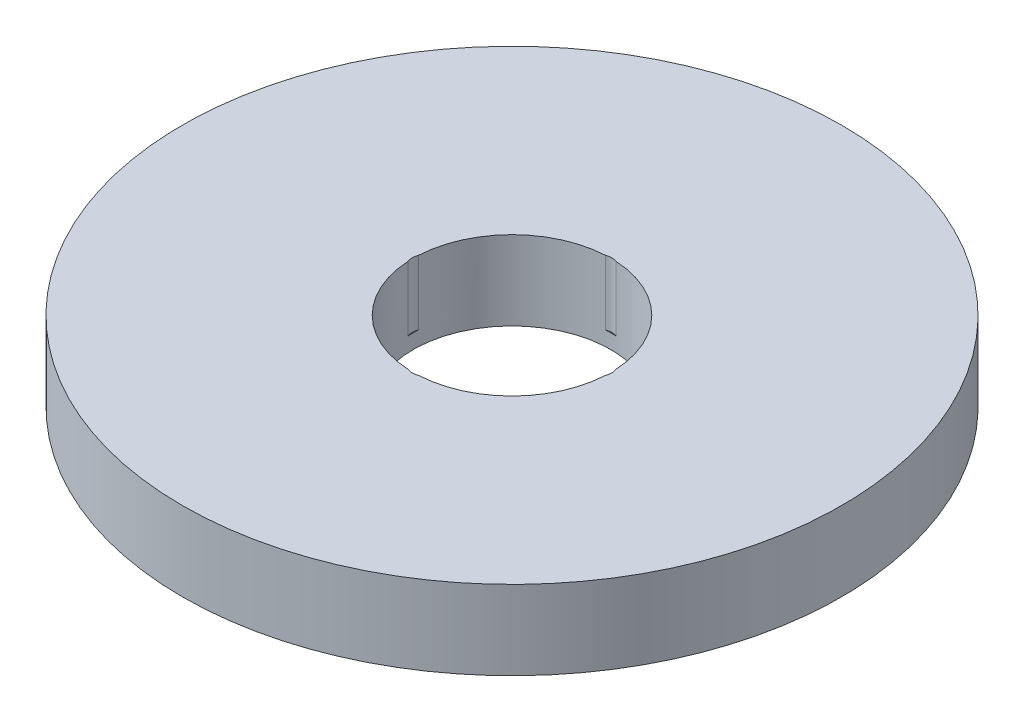
ISO-10303-21;
HEADER;
FILE_DESCRIPTION(('STEP AP214'),'2;1');
FILE_NAME('part.step','',(''),(''),'','','');
FILE_SCHEMA(('AUTOMOTIVE_DESIGN { 1 0 10303 214 1 1 1 1 }'));
ENDSEC;
DATA;
#1=APPLICATION_CONTEXT('core data for automotive mechanical design processes');
#2=APPLICATION_PROTOCOL_DEFINITION('international standard','automotive_design',2000,#1);
#3=PRODUCT_CONTEXT('',#1,'mechanical');
#4=PRODUCT('Part','Part','',(#3));
#5=PRODUCT_RELATED_PRODUCT_CATEGORY('part','',(#4));
#6=PRODUCT_DEFINITION_FORMATION('','',#4);
#7=PRODUCT_DEFINITION_CONTEXT('part definition',#1,'design');
#8=PRODUCT_DEFINITION('design','',#6,#7);
#9=PRODUCT_DEFINITION_SHAPE('','',#8);
#10=(LENGTH_UNIT() NAMED_UNIT(*) SI_UNIT(.MILLI.,.METRE.));
#11=(NAMED_UNIT(*) PLANE_ANGLE_UNIT() SI_UNIT($,.RADIAN.));
#12=(NAMED_UNIT(*) SI_UNIT($,.STERADIAN.) SOLID_ANGLE_UNIT());
#13=UNCERTAINTY_MEASURE_WITH_UNIT(LENGTH_MEASURE(1.E-05),#10,'distance_accuracy_value','');
#14=(GEOMETRIC_REPRESENTATION_CONTEXT(3) GLOBAL_UNCERTAINTY_ASSIGNED_CONTEXT((#13)) GLOBAL_UNIT_ASSIGNED_CONTEXT((#10,
#11,#12)) REPRESENTATION_CONTEXT('',''));
#15=CARTESIAN_POINT('',(0.,0.,0.));
#16=DIRECTION('',(0.,0.,1.));
#17=DIRECTION('',(1.,0.,0.));
#18=AXIS2_PLACEMENT_3D('',#15,#16,#17);
#19=CARTESIAN_POINT('',(0.,12.,0.));
#20=DIRECTION('',(0.,-1.,0.));
#21=DIRECTION('',(0.,0.,-1.));
#22=AXIS2_PLACEMENT_3D('',#19,#20,#21);
#23=CYLINDRICAL_SURFACE('',#22,50.);
#24=CARTESIAN_POINT('',(0.,12.,0.));
#25=DIRECTION('',(0.,1.,0.));
#26=DIRECTION('',(0.,0.,1.));
#27=AXIS2_PLACEMENT_3D('',#24,#25,#26);
#28=CIRCLE('',#27,50.);
#29=CARTESIAN_POINT('',(0.,12.,50.));
#30=VERTEX_POINT('',#29);
#31=EDGE_CURVE('E148',#30,#30,#28,.T.);
#32=ORIENTED_EDGE('',*,*,#31,.F.);
#33=EDGE_LOOP('',(#32));
#34=FACE_BOUND('',#33,.T.);
#35=CARTESIAN_POINT('',(0.,0.,0.));
#36=DIRECTION('',(0.,1.,0.));
#37=DIRECTION('',(0.,0.,1.));
#38=AXIS2_PLACEMENT_3D('',#35,#36,#37);
#39=CIRCLE('',#38,50.);
#40=CARTESIAN_POINT('',(0.,0.,50.));
#41=VERTEX_POINT('',#40);
#42=EDGE_CURVE('E139',#41,#41,#39,.T.);
#43=ORIENTED_EDGE('',*,*,#42,.T.);
#44=EDGE_LOOP('',(#43));
#45=FACE_BOUND('',#44,.T.);
#46=ADVANCED_FACE('F39',(#34,#45),#23,.T.);
#47=CARTESIAN_POINT('',(0.,12.,0.));
#48=DIRECTION('',(0.,1.,0.));
#49=DIRECTION('',(0.,0.,1.));
#50=AXIS2_PLACEMENT_3D('',#47,#48,#49);
#51=PLANE('',#50);
#52=CARTESIAN_POINT('',(0.,12.,13.0241337652441));
#53=DIRECTION('',(0.,1.,0.));
#54=DIRECTION('',(1.,0.,0.));
#55=AXIS2_PLACEMENT_3D('',#52,#53,#54);
#56=CIRCLE('',#55,2.10601295915814);
#57=CARTESIAN_POINT('',(-0.781934237082685,12.,14.9796054303469));
#58=VERTEX_POINT('',#57);
#59=CARTESIAN_POINT('',(0.78193423708279,12.,14.9796054303469));
#60=VERTEX_POINT('',#59);
#61=EDGE_CURVE('E175',#58,#60,#56,.T.);
#62=ORIENTED_EDGE('',*,*,#61,.F.);
#63=CARTESIAN_POINT('',(0.,12.,0.));
#64=DIRECTION('',(0.,1.,0.));
#65=DIRECTION('',(0.,0.,1.));
#66=AXIS2_PLACEMENT_3D('',#63,#64,#65);
#67=CIRCLE('',#66,15.);
#68=CARTESIAN_POINT('',(-14.9796054303469,12.,0.781934237082738));
#69=VERTEX_POINT('',#68);
#70=EDGE_CURVE('E134',#69,#58,#67,.T.);
#71=ORIENTED_EDGE('',*,*,#70,.F.);
#72=CARTESIAN_POINT('',(-13.0241337652441,12.,0.));
#73=DIRECTION('',(0.,1.,0.));
#74=DIRECTION('',(0.,0.,1.));
#75=AXIS2_PLACEMENT_3D('',#72,#73,#74);
#76=CIRCLE('',#75,2.10601295915814);
#77=CARTESIAN_POINT('',(-14.9796054303469,12.,-0.781934237082738));
#78=VERTEX_POINT('',#77);
#79=EDGE_CURVE('E143',#78,#69,#76,.T.);
#80=ORIENTED_EDGE('',*,*,#79,.F.);
#81=CARTESIAN_POINT('',(-0.781934237082895,12.,-14.9796054303469));
#82=VERTEX_POINT('',#81);
#83=EDGE_CURVE('E123',#82,#78,#67,.T.);
#84=ORIENTED_EDGE('',*,*,#83,.F.);
#85=CARTESIAN_POINT('',(-1.3642055998784E-13,12.,-13.0241337652441));
#86=DIRECTION('',(0.,1.,0.));
#87=DIRECTION('',(-1.,0.,0.));
#88=AXIS2_PLACEMENT_3D('',#85,#86,#87);
#89=CIRCLE('',#88,2.10601295915814);
#90=CARTESIAN_POINT('',(0.781934237082581,12.,-14.9796054303469));
#91=VERTEX_POINT('',#90);
#92=EDGE_CURVE('E106',#91,#82,#89,.T.);
#93=ORIENTED_EDGE('',*,*,#92,.F.);
#94=CARTESIAN_POINT('',(14.9796054303469,12.,-0.781934237082738));
#95=VERTEX_POINT('',#94);
#96=EDGE_CURVE('E125',#95,#91,#67,.T.);
#97=ORIENTED_EDGE('',*,*,#96,.F.);
#98=CARTESIAN_POINT('',(13.0241337652441,12.,0.));
#99=DIRECTION('',(0.,1.,0.));
#100=DIRECTION('',(0.,0.,-1.));
#101=AXIS2_PLACEMENT_3D('',#98,#99,#100);
#102=CIRCLE('',#101,2.10601295915814);
#103=CARTESIAN_POINT('',(14.9796054303469,12.,0.781934237082738));
#104=VERTEX_POINT('',#103);
#105=EDGE_CURVE('E286',#104,#95,#102,.T.);
#106=ORIENTED_EDGE('',*,*,#105,.F.);
#107=EDGE_CURVE('E135',#60,#104,#67,.T.);
#108=ORIENTED_EDGE('',*,*,#107,.F.);
#109=EDGE_LOOP('',(#62,#71,#80,#84,#93,#97,#106,#108));
#110=FACE_BOUND('',#109,.T.);
#111=ORIENTED_EDGE('',*,*,#31,.T.);
#112=EDGE_LOOP('',(#111));
#113=FACE_BOUND('',#112,.T.);
#114=ADVANCED_FACE('F118',(#110,#113),#51,.T.);
#115=CARTESIAN_POINT('',(0.,0.,0.));
#116=DIRECTION('',(0.,1.,0.));
#117=DIRECTION('',(0.,0.,1.));
#118=AXIS2_PLACEMENT_3D('',#115,#116,#117);
#119=PLANE('',#118);
#120=CARTESIAN_POINT('',(0.,0.,0.));
#121=DIRECTION('',(0.,1.,0.));
#122=DIRECTION('',(0.,0.,1.));
#123=AXIS2_PLACEMENT_3D('',#120,#121,#122);
#124=CIRCLE('',#123,15.);
#125=CARTESIAN_POINT('',(0.,0.,15.));
#126=VERTEX_POINT('',#125);
#127=EDGE_CURVE('E136',#126,#126,#124,.T.);
#128=ORIENTED_EDGE('',*,*,#127,.T.);
#129=EDGE_LOOP('',(#128));
#130=FACE_BOUND('',#129,.T.);
#131=ORIENTED_EDGE('',*,*,#42,.F.);
#132=EDGE_LOOP('',(#131));
#133=FACE_BOUND('',#132,.T.);
#134=ADVANCED_FACE('F187',(#130,#133),#119,.F.);
#135=CARTESIAN_POINT('',(0.,12.,0.));
#136=DIRECTION('',(0.,-1.,0.));
#137=DIRECTION('',(0.,0.,-1.));
#138=AXIS2_PLACEMENT_3D('',#135,#136,#137);
#139=CYLINDRICAL_SURFACE('',#138,15.);
#140=DIRECTION('',(0.,1.,0.));
#141=VECTOR('',#140,1.);
#142=CARTESIAN_POINT('',(-0.781934237082687,7.10051957144951,14.9796054303469));
#143=LINE('',#142,#141);
#144=CARTESIAN_POINT('',(-0.781934237082685,2.20103914289903,14.9796054303469));
#145=VERTEX_POINT('',#144);
#146=EDGE_CURVE('E11',#145,#58,#143,.T.);
#147=ORIENTED_EDGE('',*,*,#146,.F.);
#148=CARTESIAN_POINT('',(0.,2.20103914289903,0.));
#149=DIRECTION('',(0.,1.,0.));
#150=DIRECTION('',(0.,0.,1.));
#151=AXIS2_PLACEMENT_3D('',#148,#149,#150);
#152=CIRCLE('',#151,15.);
#153=CARTESIAN_POINT('',(0.78193423708279,2.20103914289903,14.9796054303469));
#154=VERTEX_POINT('',#153);
#155=EDGE_CURVE('E170',#145,#154,#152,.T.);
#156=ORIENTED_EDGE('',*,*,#155,.T.);
#157=DIRECTION('',(0.,1.,0.));
#158=VECTOR('',#157,1.);
#159=CARTESIAN_POINT('',(0.781934237082792,7.10051957144951,14.9796054303469));
#160=LINE('',#159,#158);
#161=EDGE_CURVE('E46',#60,#154,#160,.F.);
#162=ORIENTED_EDGE('',*,*,#161,.F.);
#163=ORIENTED_EDGE('',*,*,#107,.T.);
#164=DIRECTION('',(0.,1.,0.));
#165=VECTOR('',#164,1.);
#166=CARTESIAN_POINT('',(14.9796054303469,7.10051957144951,0.781934237082739));
#167=LINE('',#166,#165);
#168=CARTESIAN_POINT('',(14.9796054303469,2.20103914289903,0.781934237082738));
#169=VERTEX_POINT('',#168);
#170=EDGE_CURVE('E164',#169,#104,#167,.T.);
#171=ORIENTED_EDGE('',*,*,#170,.F.);
#172=CARTESIAN_POINT('',(0.,2.20103914289903,0.));
#173=DIRECTION('',(0.,1.,0.));
#174=DIRECTION('',(0.,0.,1.));
#175=AXIS2_PLACEMENT_3D('',#172,#173,#174);
#176=CIRCLE('',#175,15.);
#177=CARTESIAN_POINT('',(14.9796054303469,2.20103914289903,-0.781934237082738));
#178=VERTEX_POINT('',#177);
#179=EDGE_CURVE('E115',#169,#178,#176,.T.);
#180=ORIENTED_EDGE('',*,*,#179,.T.);
#181=DIRECTION('',(0.,1.,0.));
#182=VECTOR('',#181,1.);
#183=CARTESIAN_POINT('',(14.9796054303469,7.10051957144951,-0.781934237082739));
#184=LINE('',#183,#182);
#185=EDGE_CURVE('E131',#95,#178,#184,.F.);
#186=ORIENTED_EDGE('',*,*,#185,.F.);
#187=ORIENTED_EDGE('',*,*,#96,.T.);
#188=DIRECTION('',(0.,1.,0.));
#189=VECTOR('',#188,1.);
#190=CARTESIAN_POINT('',(0.781934237082583,7.10051957144951,-14.9796054303469));
#191=LINE('',#190,#189);
#192=CARTESIAN_POINT('',(0.781934237082581,2.20103914289903,-14.9796054303469));
#193=VERTEX_POINT('',#192);
#194=EDGE_CURVE('E105',#193,#91,#191,.T.);
#195=ORIENTED_EDGE('',*,*,#194,.F.);
#196=CARTESIAN_POINT('',(0.,2.20103914289903,0.));
#197=DIRECTION('',(0.,1.,0.));
#198=DIRECTION('',(0.,0.,1.));
#199=AXIS2_PLACEMENT_3D('',#196,#197,#198);
#200=CIRCLE('',#199,15.);
#201=CARTESIAN_POINT('',(-0.781934237082895,2.20103914289903,-14.9796054303469));
#202=VERTEX_POINT('',#201);
#203=EDGE_CURVE('E159',#193,#202,#200,.T.);
#204=ORIENTED_EDGE('',*,*,#203,.T.);
#205=DIRECTION('',(0.,1.,0.));
#206=VECTOR('',#205,1.);
#207=CARTESIAN_POINT('',(-0.781934237082896,7.10051957144951,-14.9796054303469));
#208=LINE('',#207,#206);
#209=EDGE_CURVE('E114',#82,#202,#208,.F.);
#210=ORIENTED_EDGE('',*,*,#209,.F.);
#211=ORIENTED_EDGE('',*,*,#83,.T.);
#212=DIRECTION('',(0.,1.,0.));
#213=VECTOR('',#212,1.);
#214=CARTESIAN_POINT('',(-14.9796054303469,7.10051957144951,-0.781934237082739));
#215=LINE('',#214,#213);
#216=CARTESIAN_POINT('',(-14.9796054303469,2.20103914289903,-0.781934237082738));
#217=VERTEX_POINT('',#216);
#218=EDGE_CURVE('E160',#217,#78,#215,.T.);
#219=ORIENTED_EDGE('',*,*,#218,.F.);
#220=CARTESIAN_POINT('',(0.,2.20103914289903,0.));
#221=DIRECTION('',(0.,1.,0.));
#222=DIRECTION('',(0.,0.,1.));
#223=AXIS2_PLACEMENT_3D('',#220,#221,#222);
#224=CIRCLE('',#223,15.);
#225=CARTESIAN_POINT('',(-14.9796054303469,2.20103914289903,0.781934237082738));
#226=VERTEX_POINT('',#225);
#227=EDGE_CURVE('E149',#217,#226,#224,.T.);
#228=ORIENTED_EDGE('',*,*,#227,.T.);
#229=DIRECTION('',(0.,1.,0.));
#230=VECTOR('',#229,1.);
#231=CARTESIAN_POINT('',(-14.9796054303469,7.10051957144951,0.781934237082739));
#232=LINE('',#231,#230);
#233=EDGE_CURVE('E152',#69,#226,#232,.F.);
#234=ORIENTED_EDGE('',*,*,#233,.F.);
#235=ORIENTED_EDGE('',*,*,#70,.T.);
#236=EDGE_LOOP('',(#147,#156,#162,#163,#171,#180,#186,#187,#195,#204,#210,#211,#219,#228,#234,#235));
#237=FACE_BOUND('',#236,.T.);
#238=ORIENTED_EDGE('',*,*,#127,.F.);
#239=EDGE_LOOP('',(#238));
#240=FACE_BOUND('',#239,.T.);
#241=ADVANCED_FACE('F126',(#237,#240),#139,.F.);
#242=CARTESIAN_POINT('',(-13.0241337652441,2.20103914289903,0.));
#243=DIRECTION('',(0.,1.,0.));
#244=DIRECTION('',(0.,0.,1.));
#245=AXIS2_PLACEMENT_3D('',#242,#243,#244);
#246=CYLINDRICAL_SURFACE('',#245,2.10601295915814);
#247=ORIENTED_EDGE('',*,*,#218,.T.);
#248=ORIENTED_EDGE('',*,*,#79,.T.);
#249=ORIENTED_EDGE('',*,*,#233,.T.);
#250=CARTESIAN_POINT('',(-13.0241337652441,2.20103914289903,0.));
#251=DIRECTION('',(0.,1.,0.));
#252=DIRECTION('',(0.,0.,1.));
#253=AXIS2_PLACEMENT_3D('',#250,#251,#252);
#254=CIRCLE('',#253,2.10601295915814);
#255=EDGE_CURVE('E144',#217,#226,#254,.T.);
#256=ORIENTED_EDGE('',*,*,#255,.F.);
#257=EDGE_LOOP('',(#247,#248,#249,#256));
#258=FACE_BOUND('',#257,.T.);
#259=ADVANCED_FACE('F200',(#258),#246,.F.);
#260=CARTESIAN_POINT('',(-13.0241337652441,2.20103914289903,0.));
#261=DIRECTION('',(0.,1.,0.));
#262=DIRECTION('',(0.,0.,1.));
#263=AXIS2_PLACEMENT_3D('',#260,#261,#262);
#264=PLANE('',#263);
#265=ORIENTED_EDGE('',*,*,#255,.T.);
#266=ORIENTED_EDGE('',*,*,#227,.F.);
#267=EDGE_LOOP('',(#265,#266));
#268=FACE_BOUND('',#267,.T.);
#269=ADVANCED_FACE('F201',(#268),#264,.T.);
#270=CARTESIAN_POINT('',(-1.3642055998784E-13,2.20103914289903,-13.0241337652441));
#271=DIRECTION('',(0.,1.,0.));
#272=DIRECTION('',(0.,0.,1.));
#273=AXIS2_PLACEMENT_3D('',#270,#271,#272);
#274=CYLINDRICAL_SURFACE('',#273,2.10601295915814);
#275=ORIENTED_EDGE('',*,*,#194,.T.);
#276=ORIENTED_EDGE('',*,*,#92,.T.);
#277=ORIENTED_EDGE('',*,*,#209,.T.);
#278=CARTESIAN_POINT('',(-1.3642055998784E-13,2.20103914289903,-13.0241337652441));
#279=DIRECTION('',(0.,1.,0.));
#280=DIRECTION('',(-1.,0.,0.));
#281=AXIS2_PLACEMENT_3D('',#278,#279,#280);
#282=CIRCLE('',#281,2.10601295915814);
#283=EDGE_CURVE('E107',#193,#202,#282,.T.);
#284=ORIENTED_EDGE('',*,*,#283,.F.);
#285=EDGE_LOOP('',(#275,#276,#277,#284));
#286=FACE_BOUND('',#285,.T.);
#287=ADVANCED_FACE('F102',(#286),#274,.F.);
#288=CARTESIAN_POINT('',(-1.3642055998784E-13,2.20103914289903,-13.0241337652441));
#289=DIRECTION('',(0.,1.,0.));
#290=DIRECTION('',(-1.,0.,0.));
#291=AXIS2_PLACEMENT_3D('',#288,#289,#290);
#292=PLANE('',#291);
#293=ORIENTED_EDGE('',*,*,#283,.T.);
#294=ORIENTED_EDGE('',*,*,#203,.F.);
#295=EDGE_LOOP('',(#293,#294));
#296=FACE_BOUND('',#295,.T.);
#297=ADVANCED_FACE('F209',(#296),#292,.T.);
#298=CARTESIAN_POINT('',(13.0241337652441,2.20103914289903,0.));
#299=DIRECTION('',(0.,1.,0.));
#300=DIRECTION('',(0.,0.,1.));
#301=AXIS2_PLACEMENT_3D('',#298,#299,#300);
#302=CYLINDRICAL_SURFACE('',#301,2.10601295915814);
#303=ORIENTED_EDGE('',*,*,#170,.T.);
#304=ORIENTED_EDGE('',*,*,#105,.T.);
#305=ORIENTED_EDGE('',*,*,#185,.T.);
#306=CARTESIAN_POINT('',(13.0241337652441,2.20103914289903,0.));
#307=DIRECTION('',(0.,1.,0.));
#308=DIRECTION('',(0.,0.,-1.));
#309=AXIS2_PLACEMENT_3D('',#306,#307,#308);
#310=CIRCLE('',#309,2.10601295915814);
#311=EDGE_CURVE('E56',#169,#178,#310,.T.);
#312=ORIENTED_EDGE('',*,*,#311,.F.);
#313=EDGE_LOOP('',(#303,#304,#305,#312));
#314=FACE_BOUND('',#313,.T.);
#315=ADVANCED_FACE('F213',(#314),#302,.F.);
#316=CARTESIAN_POINT('',(13.0241337652441,2.20103914289903,0.));
#317=DIRECTION('',(0.,1.,0.));
#318=DIRECTION('',(0.,0.,-1.));
#319=AXIS2_PLACEMENT_3D('',#316,#317,#318);
#320=PLANE('',#319);
#321=ORIENTED_EDGE('',*,*,#311,.T.);
#322=ORIENTED_EDGE('',*,*,#179,.F.);
#323=EDGE_LOOP('',(#321,#322));
#324=FACE_BOUND('',#323,.T.);
#325=ADVANCED_FACE('F179',(#324),#320,.T.);
#326=CARTESIAN_POINT('',(0.,2.20103914289903,13.0241337652441));
#327=DIRECTION('',(0.,1.,0.));
#328=DIRECTION('',(0.,0.,1.));
#329=AXIS2_PLACEMENT_3D('',#326,#327,#328);
#330=CYLINDRICAL_SURFACE('',#329,2.10601295915814);
#331=ORIENTED_EDGE('',*,*,#146,.T.);
#332=ORIENTED_EDGE('',*,*,#61,.T.);
#333=ORIENTED_EDGE('',*,*,#161,.T.);
#334=CARTESIAN_POINT('',(0.,2.20103914289903,13.0241337652441));
#335=DIRECTION('',(0.,1.,0.));
#336=DIRECTION('',(1.,0.,0.));
#337=AXIS2_PLACEMENT_3D('',#334,#335,#336);
#338=CIRCLE('',#337,2.10601295915814);
#339=EDGE_CURVE('E55',#145,#154,#338,.T.);
#340=ORIENTED_EDGE('',*,*,#339,.F.);
#341=EDGE_LOOP('',(#331,#332,#333,#340));
#342=FACE_BOUND('',#341,.T.);
#343=ADVANCED_FACE('F171',(#342),#330,.F.);
#344=CARTESIAN_POINT('',(0.,2.20103914289903,13.0241337652441));
#345=DIRECTION('',(0.,1.,0.));
#346=DIRECTION('',(1.,0.,0.));
#347=AXIS2_PLACEMENT_3D('',#344,#345,#346);
#348=PLANE('',#347);
#349=ORIENTED_EDGE('',*,*,#339,.T.);
#350=ORIENTED_EDGE('',*,*,#155,.F.);
#351=EDGE_LOOP('',(#349,#350));
#352=FACE_BOUND('',#351,.T.);
#353=ADVANCED_FACE('F173',(#352),#348,.T.);
#354=CLOSED_SHELL('',(#46,#114,#134,#241,#259,#269,#287,#297,#315,#325,#343,#353));
#355=MANIFOLD_SOLID_BREP('B2',#354);
#356=ADVANCED_BREP_SHAPE_REPRESENTATION('',(#18,#355),#14);
#357=SHAPE_DEFINITION_REPRESENTATION(#9,#356);
ENDSEC;
END-ISO-10303-21;
